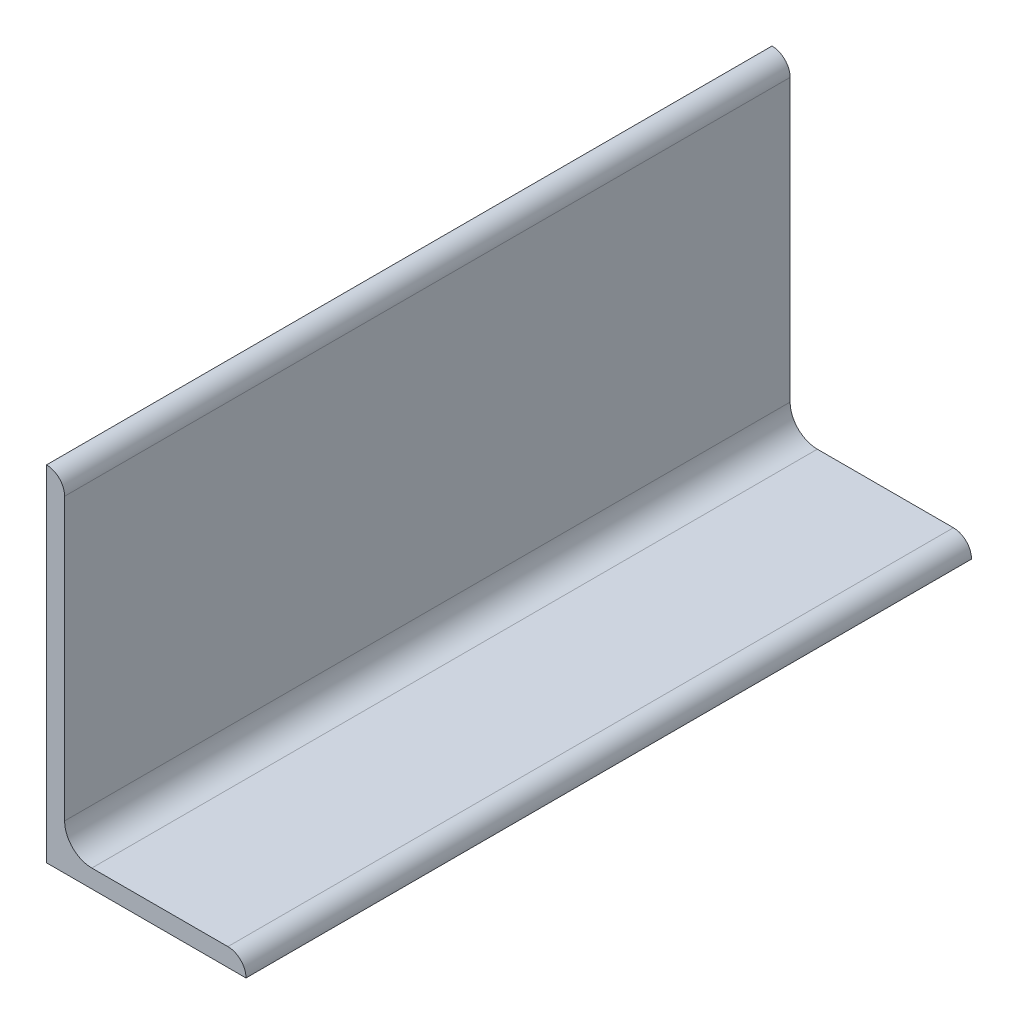
ISO-10303-21;
HEADER;
FILE_DESCRIPTION(('STEP AP214'),'2;1');
FILE_NAME('part.step','',(''),(''),'','','');
FILE_SCHEMA(('AUTOMOTIVE_DESIGN { 1 0 10303 214 1 1 1 1 }'));
ENDSEC;
DATA;
#1=APPLICATION_CONTEXT('core data for automotive mechanical design processes');
#2=APPLICATION_PROTOCOL_DEFINITION('international standard','automotive_design',2000,#1);
#3=PRODUCT_CONTEXT('',#1,'mechanical');
#4=PRODUCT('Part','Part','',(#3));
#5=PRODUCT_RELATED_PRODUCT_CATEGORY('part','',(#4));
#6=PRODUCT_DEFINITION_FORMATION('','',#4);
#7=PRODUCT_DEFINITION_CONTEXT('part definition',#1,'design');
#8=PRODUCT_DEFINITION('design','',#6,#7);
#9=PRODUCT_DEFINITION_SHAPE('','',#8);
#10=(LENGTH_UNIT() NAMED_UNIT(*) SI_UNIT(.MILLI.,.METRE.));
#11=(NAMED_UNIT(*) PLANE_ANGLE_UNIT() SI_UNIT($,.RADIAN.));
#12=(NAMED_UNIT(*) SI_UNIT($,.STERADIAN.) SOLID_ANGLE_UNIT());
#13=UNCERTAINTY_MEASURE_WITH_UNIT(LENGTH_MEASURE(1.E-05),#10,'distance_accuracy_value','');
#14=(GEOMETRIC_REPRESENTATION_CONTEXT(3) GLOBAL_UNCERTAINTY_ASSIGNED_CONTEXT((#13)) GLOBAL_UNIT_ASSIGNED_CONTEXT((#10,
#11,#12)) REPRESENTATION_CONTEXT('',''));
#15=CARTESIAN_POINT('',(0.,0.,0.));
#16=DIRECTION('',(0.,0.,1.));
#17=DIRECTION('',(1.,0.,0.));
#18=AXIS2_PLACEMENT_3D('',#15,#16,#17);
#19=CARTESIAN_POINT('',(34.925,0.,63.5));
#20=DIRECTION('',(0.,1.,0.));
#21=DIRECTION('',(-1.,0.,0.));
#22=AXIS2_PLACEMENT_3D('',#19,#20,#21);
#23=PLANE('',#22);
#24=DIRECTION('',(1.,0.,0.));
#25=VECTOR('',#24,1.);
#26=CARTESIAN_POINT('',(34.925,0.,-63.5));
#27=LINE('',#26,#25);
#28=CARTESIAN_POINT('',(0.,0.,-63.5));
#29=VERTEX_POINT('',#28);
#30=CARTESIAN_POINT('',(34.925,0.,-63.5));
#31=VERTEX_POINT('',#30);
#32=EDGE_CURVE('E135',#29,#31,#27,.T.);
#33=ORIENTED_EDGE('',*,*,#32,.T.);
#34=DIRECTION('',(0.,0.,-1.));
#35=VECTOR('',#34,1.);
#36=CARTESIAN_POINT('',(34.925,0.,63.5));
#37=LINE('',#36,#35);
#38=CARTESIAN_POINT('',(34.925,0.,63.5));
#39=VERTEX_POINT('',#38);
#40=EDGE_CURVE('E11',#39,#31,#37,.T.);
#41=ORIENTED_EDGE('',*,*,#40,.F.);
#42=DIRECTION('',(1.,0.,0.));
#43=VECTOR('',#42,1.);
#44=CARTESIAN_POINT('',(34.925,0.,63.5));
#45=LINE('',#44,#43);
#46=CARTESIAN_POINT('',(0.,0.,63.5));
#47=VERTEX_POINT('',#46);
#48=EDGE_CURVE('E151',#47,#39,#45,.T.);
#49=ORIENTED_EDGE('',*,*,#48,.F.);
#50=DIRECTION('',(0.,0.,-1.));
#51=VECTOR('',#50,1.);
#52=CARTESIAN_POINT('',(0.,0.,63.5));
#53=LINE('',#52,#51);
#54=EDGE_CURVE('E131',#47,#29,#53,.T.);
#55=ORIENTED_EDGE('',*,*,#54,.T.);
#56=EDGE_LOOP('',(#33,#41,#49,#55));
#57=FACE_BOUND('',#56,.T.);
#58=ADVANCED_FACE('F33',(#57),#23,.F.);
#59=CARTESIAN_POINT('',(34.925,0.00508000000000039,63.5));
#60=DIRECTION('',(-1.,0.,0.));
#61=DIRECTION('',(0.,0.,1.));
#62=AXIS2_PLACEMENT_3D('',#59,#60,#61);
#63=PLANE('',#62);
#64=DIRECTION('',(0.,1.,0.));
#65=VECTOR('',#64,1.);
#66=CARTESIAN_POINT('',(34.925,0.00508000000000039,-63.5));
#67=LINE('',#66,#65);
#68=CARTESIAN_POINT('',(34.925,0.00508000000000039,-63.5));
#69=VERTEX_POINT('',#68);
#70=EDGE_CURVE('E138',#31,#69,#67,.T.);
#71=ORIENTED_EDGE('',*,*,#70,.T.);
#72=DIRECTION('',(0.,0.,-1.));
#73=VECTOR('',#72,1.);
#74=CARTESIAN_POINT('',(34.925,0.00508000000000039,63.5));
#75=LINE('',#74,#73);
#76=CARTESIAN_POINT('',(34.925,0.00508000000000039,63.5));
#77=VERTEX_POINT('',#76);
#78=EDGE_CURVE('E41',#77,#69,#75,.T.);
#79=ORIENTED_EDGE('',*,*,#78,.F.);
#80=DIRECTION('',(0.,1.,0.));
#81=VECTOR('',#80,1.);
#82=CARTESIAN_POINT('',(34.925,0.00508000000000039,63.5));
#83=LINE('',#82,#81);
#84=EDGE_CURVE('E95',#39,#77,#83,.T.);
#85=ORIENTED_EDGE('',*,*,#84,.F.);
#86=ORIENTED_EDGE('',*,*,#40,.T.);
#87=EDGE_LOOP('',(#71,#79,#85,#86));
#88=FACE_BOUND('',#87,.T.);
#89=ADVANCED_FACE('F194',(#88),#63,.F.);
#90=CARTESIAN_POINT('',(31.75508,0.00508,63.5));
#91=DIRECTION('',(0.,0.,-1.));
#92=DIRECTION('',(-1.,0.,0.));
#93=AXIS2_PLACEMENT_3D('',#90,#91,#92);
#94=CYLINDRICAL_SURFACE('',#93,3.16992);
#95=CARTESIAN_POINT('',(31.75508,0.00508,-63.5));
#96=DIRECTION('',(0.,0.,1.));
#97=DIRECTION('',(1.,0.,0.));
#98=AXIS2_PLACEMENT_3D('',#95,#96,#97);
#99=CIRCLE('',#98,3.16992);
#100=CARTESIAN_POINT('',(31.75508,3.175,-63.5));
#101=VERTEX_POINT('',#100);
#102=EDGE_CURVE('E140',#69,#101,#99,.T.);
#103=ORIENTED_EDGE('',*,*,#102,.T.);
#104=DIRECTION('',(0.,0.,-1.));
#105=VECTOR('',#104,1.);
#106=CARTESIAN_POINT('',(31.75508,3.175,63.5));
#107=LINE('',#106,#105);
#108=CARTESIAN_POINT('',(31.75508,3.175,63.5));
#109=VERTEX_POINT('',#108);
#110=EDGE_CURVE('E161',#109,#101,#107,.T.);
#111=ORIENTED_EDGE('',*,*,#110,.F.);
#112=CARTESIAN_POINT('',(31.75508,0.00508,63.5));
#113=DIRECTION('',(0.,0.,1.));
#114=DIRECTION('',(1.,0.,0.));
#115=AXIS2_PLACEMENT_3D('',#112,#113,#114);
#116=CIRCLE('',#115,3.16992);
#117=EDGE_CURVE('E169',#77,#109,#116,.T.);
#118=ORIENTED_EDGE('',*,*,#117,.F.);
#119=ORIENTED_EDGE('',*,*,#78,.T.);
#120=EDGE_LOOP('',(#103,#111,#118,#119));
#121=FACE_BOUND('',#120,.T.);
#122=ADVANCED_FACE('F167',(#121),#94,.T.);
#123=CARTESIAN_POINT('',(7.93749999999999,3.175,63.5));
#124=DIRECTION('',(0.,-1.,0.));
#125=DIRECTION('',(1.,0.,0.));
#126=AXIS2_PLACEMENT_3D('',#123,#124,#125);
#127=PLANE('',#126);
#128=DIRECTION('',(-1.,0.,0.));
#129=VECTOR('',#128,1.);
#130=CARTESIAN_POINT('',(7.93749999999999,3.175,-63.5));
#131=LINE('',#130,#129);
#132=CARTESIAN_POINT('',(7.93749999999999,3.17499999999999,-63.5));
#133=VERTEX_POINT('',#132);
#134=EDGE_CURVE('E142',#101,#133,#131,.T.);
#135=ORIENTED_EDGE('',*,*,#134,.T.);
#136=DIRECTION('',(0.,0.,-1.));
#137=VECTOR('',#136,1.);
#138=CARTESIAN_POINT('',(7.93749999999999,3.17499999999999,63.5));
#139=LINE('',#138,#137);
#140=CARTESIAN_POINT('',(7.93749999999999,3.17499999999999,63.5));
#141=VERTEX_POINT('',#140);
#142=EDGE_CURVE('E158',#141,#133,#139,.T.);
#143=ORIENTED_EDGE('',*,*,#142,.F.);
#144=DIRECTION('',(-1.,0.,0.));
#145=VECTOR('',#144,1.);
#146=CARTESIAN_POINT('',(7.93749999999999,3.175,63.5));
#147=LINE('',#146,#145);
#148=EDGE_CURVE('E185',#109,#141,#147,.T.);
#149=ORIENTED_EDGE('',*,*,#148,.F.);
#150=ORIENTED_EDGE('',*,*,#110,.T.);
#151=EDGE_LOOP('',(#135,#143,#149,#150));
#152=FACE_BOUND('',#151,.T.);
#153=ADVANCED_FACE('F178',(#152),#127,.F.);
#154=CARTESIAN_POINT('',(7.93749999999999,7.93749999999999,63.5));
#155=DIRECTION('',(0.,0.,-1.));
#156=DIRECTION('',(-1.,0.,0.));
#157=AXIS2_PLACEMENT_3D('',#154,#155,#156);
#158=CYLINDRICAL_SURFACE('',#157,4.7625);
#159=CARTESIAN_POINT('',(7.93749999999999,7.93749999999999,-63.5));
#160=DIRECTION('',(0.,0.,-1.));
#161=DIRECTION('',(-1.,0.,0.));
#162=AXIS2_PLACEMENT_3D('',#159,#160,#161);
#163=CIRCLE('',#162,4.7625);
#164=CARTESIAN_POINT('',(3.17499999999999,7.93749999999999,-63.5));
#165=VERTEX_POINT('',#164);
#166=EDGE_CURVE('E144',#133,#165,#163,.T.);
#167=ORIENTED_EDGE('',*,*,#166,.T.);
#168=DIRECTION('',(0.,0.,-1.));
#169=VECTOR('',#168,1.);
#170=CARTESIAN_POINT('',(3.17499999999999,7.93749999999999,63.5));
#171=LINE('',#170,#169);
#172=CARTESIAN_POINT('',(3.17499999999999,7.93749999999999,63.5));
#173=VERTEX_POINT('',#172);
#174=EDGE_CURVE('E155',#173,#165,#171,.T.);
#175=ORIENTED_EDGE('',*,*,#174,.F.);
#176=CARTESIAN_POINT('',(7.93749999999999,7.93749999999999,63.5));
#177=DIRECTION('',(0.,0.,-1.));
#178=DIRECTION('',(-1.,0.,0.));
#179=AXIS2_PLACEMENT_3D('',#176,#177,#178);
#180=CIRCLE('',#179,4.7625);
#181=EDGE_CURVE('E184',#141,#173,#180,.T.);
#182=ORIENTED_EDGE('',*,*,#181,.F.);
#183=ORIENTED_EDGE('',*,*,#142,.T.);
#184=EDGE_LOOP('',(#167,#175,#182,#183));
#185=FACE_BOUND('',#184,.T.);
#186=ADVANCED_FACE('F182',(#185),#158,.F.);
#187=CARTESIAN_POINT('',(3.175,57.15508,63.5));
#188=DIRECTION('',(-1.,0.,0.));
#189=DIRECTION('',(0.,-1.,0.));
#190=AXIS2_PLACEMENT_3D('',#187,#188,#189);
#191=PLANE('',#190);
#192=DIRECTION('',(0.,1.,0.));
#193=VECTOR('',#192,1.);
#194=CARTESIAN_POINT('',(3.175,57.15508,-63.5));
#195=LINE('',#194,#193);
#196=CARTESIAN_POINT('',(3.175,57.15508,-63.5));
#197=VERTEX_POINT('',#196);
#198=EDGE_CURVE('E146',#165,#197,#195,.T.);
#199=ORIENTED_EDGE('',*,*,#198,.T.);
#200=DIRECTION('',(0.,0.,-1.));
#201=VECTOR('',#200,1.);
#202=CARTESIAN_POINT('',(3.175,57.15508,63.5));
#203=LINE('',#202,#201);
#204=CARTESIAN_POINT('',(3.175,57.15508,63.5));
#205=VERTEX_POINT('',#204);
#206=EDGE_CURVE('E126',#205,#197,#203,.T.);
#207=ORIENTED_EDGE('',*,*,#206,.F.);
#208=DIRECTION('',(0.,1.,0.));
#209=VECTOR('',#208,1.);
#210=CARTESIAN_POINT('',(3.175,57.15508,63.5));
#211=LINE('',#210,#209);
#212=EDGE_CURVE('E117',#173,#205,#211,.T.);
#213=ORIENTED_EDGE('',*,*,#212,.F.);
#214=ORIENTED_EDGE('',*,*,#174,.T.);
#215=EDGE_LOOP('',(#199,#207,#213,#214));
#216=FACE_BOUND('',#215,.T.);
#217=ADVANCED_FACE('F206',(#216),#191,.F.);
#218=CARTESIAN_POINT('',(0.00508000000000019,57.15508,63.5));
#219=DIRECTION('',(0.,0.,-1.));
#220=DIRECTION('',(-1.,0.,0.));
#221=AXIS2_PLACEMENT_3D('',#218,#219,#220);
#222=CYLINDRICAL_SURFACE('',#221,3.16992);
#223=CARTESIAN_POINT('',(0.00508000000000019,57.15508,-63.5));
#224=DIRECTION('',(0.,0.,1.));
#225=DIRECTION('',(-1.,0.,0.));
#226=AXIS2_PLACEMENT_3D('',#223,#224,#225);
#227=CIRCLE('',#226,3.16992);
#228=CARTESIAN_POINT('',(0.00508,60.325,-63.5));
#229=VERTEX_POINT('',#228);
#230=EDGE_CURVE('E125',#197,#229,#227,.T.);
#231=ORIENTED_EDGE('',*,*,#230,.T.);
#232=DIRECTION('',(0.,0.,-1.));
#233=VECTOR('',#232,1.);
#234=CARTESIAN_POINT('',(0.00508,60.325,63.5));
#235=LINE('',#234,#233);
#236=CARTESIAN_POINT('',(0.00508,60.325,63.5));
#237=VERTEX_POINT('',#236);
#238=EDGE_CURVE('E122',#237,#229,#235,.T.);
#239=ORIENTED_EDGE('',*,*,#238,.F.);
#240=CARTESIAN_POINT('',(0.00508000000000019,57.15508,63.5));
#241=DIRECTION('',(0.,0.,1.));
#242=DIRECTION('',(-1.,0.,0.));
#243=AXIS2_PLACEMENT_3D('',#240,#241,#242);
#244=CIRCLE('',#243,3.16992);
#245=EDGE_CURVE('E111',#205,#237,#244,.T.);
#246=ORIENTED_EDGE('',*,*,#245,.F.);
#247=ORIENTED_EDGE('',*,*,#206,.T.);
#248=EDGE_LOOP('',(#231,#239,#246,#247));
#249=FACE_BOUND('',#248,.T.);
#250=ADVANCED_FACE('F123',(#249),#222,.T.);
#251=CARTESIAN_POINT('',(0.,60.325,63.5));
#252=DIRECTION('',(0.,-1.,0.));
#253=DIRECTION('',(0.,0.,-1.));
#254=AXIS2_PLACEMENT_3D('',#251,#252,#253);
#255=PLANE('',#254);
#256=DIRECTION('',(-1.,0.,0.));
#257=VECTOR('',#256,1.);
#258=CARTESIAN_POINT('',(0.,60.325,-63.5));
#259=LINE('',#258,#257);
#260=CARTESIAN_POINT('',(0.,60.325,-63.5));
#261=VERTEX_POINT('',#260);
#262=EDGE_CURVE('E81',#229,#261,#259,.T.);
#263=ORIENTED_EDGE('',*,*,#262,.T.);
#264=DIRECTION('',(0.,0.,-1.));
#265=VECTOR('',#264,1.);
#266=CARTESIAN_POINT('',(0.,60.325,63.5));
#267=LINE('',#266,#265);
#268=CARTESIAN_POINT('',(0.,60.325,63.5));
#269=VERTEX_POINT('',#268);
#270=EDGE_CURVE('E127',#269,#261,#267,.T.);
#271=ORIENTED_EDGE('',*,*,#270,.F.);
#272=DIRECTION('',(-1.,0.,0.));
#273=VECTOR('',#272,1.);
#274=CARTESIAN_POINT('',(0.,60.325,63.5));
#275=LINE('',#274,#273);
#276=EDGE_CURVE('E115',#237,#269,#275,.T.);
#277=ORIENTED_EDGE('',*,*,#276,.F.);
#278=ORIENTED_EDGE('',*,*,#238,.T.);
#279=EDGE_LOOP('',(#263,#271,#277,#278));
#280=FACE_BOUND('',#279,.T.);
#281=ADVANCED_FACE('F129',(#280),#255,.F.);
#282=CARTESIAN_POINT('',(0.,0.,63.5));
#283=DIRECTION('',(1.,0.,0.));
#284=DIRECTION('',(0.,0.,-1.));
#285=AXIS2_PLACEMENT_3D('',#282,#283,#284);
#286=PLANE('',#285);
#287=DIRECTION('',(0.,-1.,0.));
#288=VECTOR('',#287,1.);
#289=CARTESIAN_POINT('',(0.,0.,-63.5));
#290=LINE('',#289,#288);
#291=EDGE_CURVE('E87',#261,#29,#290,.T.);
#292=ORIENTED_EDGE('',*,*,#291,.T.);
#293=ORIENTED_EDGE('',*,*,#54,.F.);
#294=DIRECTION('',(0.,-1.,0.));
#295=VECTOR('',#294,1.);
#296=CARTESIAN_POINT('',(0.,0.,63.5));
#297=LINE('',#296,#295);
#298=EDGE_CURVE('E49',#269,#47,#297,.T.);
#299=ORIENTED_EDGE('',*,*,#298,.F.);
#300=ORIENTED_EDGE('',*,*,#270,.T.);
#301=EDGE_LOOP('',(#292,#293,#299,#300));
#302=FACE_BOUND('',#301,.T.);
#303=ADVANCED_FACE('F214',(#302),#286,.F.);
#304=CARTESIAN_POINT('',(0.00508000000000019,57.15508,63.5));
#305=DIRECTION('',(0.,0.,-1.));
#306=DIRECTION('',(-1.,0.,0.));
#307=AXIS2_PLACEMENT_3D('',#304,#305,#306);
#308=PLANE('',#307);
#309=ORIENTED_EDGE('',*,*,#48,.T.);
#310=ORIENTED_EDGE('',*,*,#84,.T.);
#311=ORIENTED_EDGE('',*,*,#117,.T.);
#312=ORIENTED_EDGE('',*,*,#148,.T.);
#313=ORIENTED_EDGE('',*,*,#181,.T.);
#314=ORIENTED_EDGE('',*,*,#212,.T.);
#315=ORIENTED_EDGE('',*,*,#245,.T.);
#316=ORIENTED_EDGE('',*,*,#276,.T.);
#317=ORIENTED_EDGE('',*,*,#298,.T.);
#318=EDGE_LOOP('',(#309,#310,#311,#312,#313,#314,#315,#316,#317));
#319=FACE_BOUND('',#318,.T.);
#320=ADVANCED_FACE('F113',(#319),#308,.F.);
#321=CARTESIAN_POINT('',(0.00508000000000019,57.15508,-63.5));
#322=DIRECTION('',(0.,0.,-1.));
#323=DIRECTION('',(-1.,0.,0.));
#324=AXIS2_PLACEMENT_3D('',#321,#322,#323);
#325=PLANE('',#324);
#326=ORIENTED_EDGE('',*,*,#32,.F.);
#327=ORIENTED_EDGE('',*,*,#291,.F.);
#328=ORIENTED_EDGE('',*,*,#262,.F.);
#329=ORIENTED_EDGE('',*,*,#230,.F.);
#330=ORIENTED_EDGE('',*,*,#198,.F.);
#331=ORIENTED_EDGE('',*,*,#166,.F.);
#332=ORIENTED_EDGE('',*,*,#134,.F.);
#333=ORIENTED_EDGE('',*,*,#102,.F.);
#334=ORIENTED_EDGE('',*,*,#70,.F.);
#335=EDGE_LOOP('',(#326,#327,#328,#329,#330,#331,#332,#333,#334));
#336=FACE_BOUND('',#335,.T.);
#337=ADVANCED_FACE('F173',(#336),#325,.T.);
#338=CLOSED_SHELL('',(#58,#89,#122,#153,#186,#217,#250,#281,#303,#320,#337));
#339=MANIFOLD_SOLID_BREP('B2',#338);
#340=ADVANCED_BREP_SHAPE_REPRESENTATION('',(#18,#339),#14);
#341=SHAPE_DEFINITION_REPRESENTATION(#9,#340);
ENDSEC;
END-ISO-10303-21;
